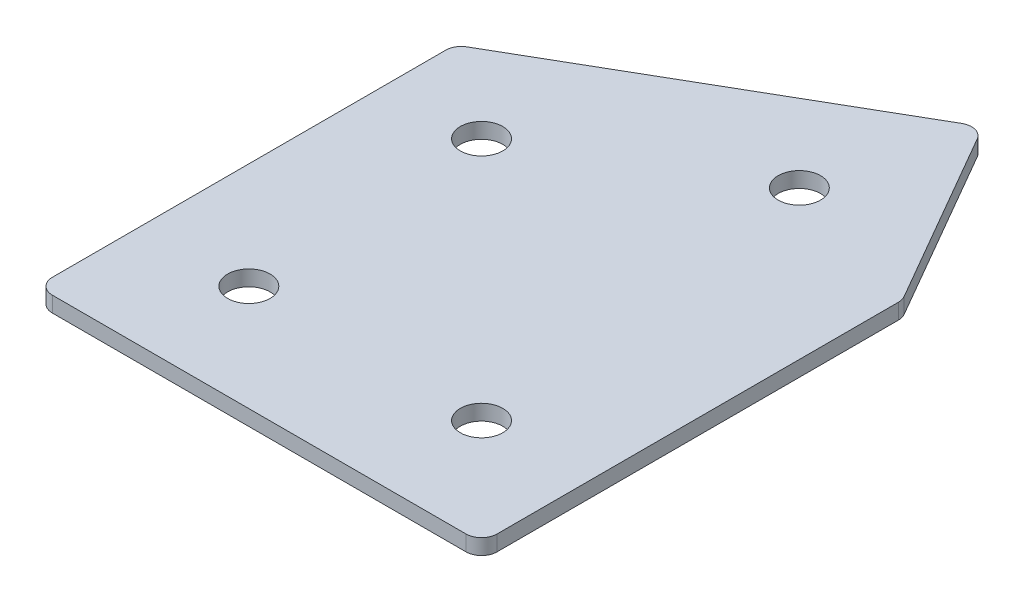
ISO-10303-21;
HEADER;
FILE_DESCRIPTION(('STEP AP214'),'2;1');
FILE_NAME('part.step','',(''),(''),'','','');
FILE_SCHEMA(('AUTOMOTIVE_DESIGN { 1 0 10303 214 1 1 1 1 }'));
ENDSEC;
DATA;
#1=APPLICATION_CONTEXT('core data for automotive mechanical design processes');
#2=APPLICATION_PROTOCOL_DEFINITION('international standard','automotive_design',2000,#1);
#3=PRODUCT_CONTEXT('',#1,'mechanical');
#4=PRODUCT('Part','Part','',(#3));
#5=PRODUCT_RELATED_PRODUCT_CATEGORY('part','',(#4));
#6=PRODUCT_DEFINITION_FORMATION('','',#4);
#7=PRODUCT_DEFINITION_CONTEXT('part definition',#1,'design');
#8=PRODUCT_DEFINITION('design','',#6,#7);
#9=PRODUCT_DEFINITION_SHAPE('','',#8);
#10=(LENGTH_UNIT() NAMED_UNIT(*) SI_UNIT(.MILLI.,.METRE.));
#11=(NAMED_UNIT(*) PLANE_ANGLE_UNIT() SI_UNIT($,.RADIAN.));
#12=(NAMED_UNIT(*) SI_UNIT($,.STERADIAN.) SOLID_ANGLE_UNIT());
#13=UNCERTAINTY_MEASURE_WITH_UNIT(LENGTH_MEASURE(1.E-05),#10,'distance_accuracy_value','');
#14=(GEOMETRIC_REPRESENTATION_CONTEXT(3) GLOBAL_UNCERTAINTY_ASSIGNED_CONTEXT((#13)) GLOBAL_UNIT_ASSIGNED_CONTEXT((#10,
#11,#12)) REPRESENTATION_CONTEXT('',''));
#15=CARTESIAN_POINT('',(0.,0.,0.));
#16=DIRECTION('',(0.,0.,1.));
#17=DIRECTION('',(1.,0.,0.));
#18=AXIS2_PLACEMENT_3D('',#15,#16,#17);
#19=CARTESIAN_POINT('',(0.,0.,0.));
#20=DIRECTION('',(0.,1.,0.));
#21=DIRECTION('',(0.,0.,1.));
#22=AXIS2_PLACEMENT_3D('',#19,#20,#21);
#23=PLANE('',#22);
#24=CARTESIAN_POINT('',(128.971143170306,0.,0.));
#25=DIRECTION('',(0.,1.,0.));
#26=DIRECTION('',(0.,0.,1.));
#27=AXIS2_PLACEMENT_3D('',#24,#25,#26);
#28=CIRCLE('',#27,4.09999999999999);
#29=CARTESIAN_POINT('',(128.971143170306,0.,4.09999999999999));
#30=VERTEX_POINT('',#29);
#31=EDGE_CURVE('E201',#30,#30,#28,.T.);
#32=ORIENTED_EDGE('',*,*,#31,.T.);
#33=EDGE_LOOP('',(#32));
#34=FACE_BOUND('',#33,.T.);
#35=CARTESIAN_POINT('',(120.735571585156,0.,-69.7067147554497));
#36=DIRECTION('',(0.,1.,0.));
#37=DIRECTION('',(0.,0.,1.));
#38=AXIS2_PLACEMENT_3D('',#35,#36,#37);
#39=CIRCLE('',#38,4.09999999999998);
#40=CARTESIAN_POINT('',(120.735571585156,0.,-65.6067147554498));
#41=VERTEX_POINT('',#40);
#42=EDGE_CURVE('E195',#41,#41,#39,.T.);
#43=ORIENTED_EDGE('',*,*,#42,.T.);
#44=EDGE_LOOP('',(#43));
#45=FACE_BOUND('',#44,.T.);
#46=CARTESIAN_POINT('',(81.764428414856,0.,-47.2067147554497));
#47=DIRECTION('',(0.,1.,0.));
#48=DIRECTION('',(0.,0.,1.));
#49=AXIS2_PLACEMENT_3D('',#46,#47,#48);
#50=CIRCLE('',#49,4.1);
#51=CARTESIAN_POINT('',(81.764428414856,0.,-43.1067147554497));
#52=VERTEX_POINT('',#51);
#53=EDGE_CURVE('E189',#52,#52,#50,.T.);
#54=ORIENTED_EDGE('',*,*,#53,.T.);
#55=EDGE_LOOP('',(#54));
#56=FACE_BOUND('',#55,.T.);
#57=CARTESIAN_POINT('',(83.9711431703057,0.,0.));
#58=DIRECTION('',(0.,1.,0.));
#59=DIRECTION('',(0.,0.,1.));
#60=AXIS2_PLACEMENT_3D('',#57,#58,#59);
#61=CIRCLE('',#60,4.1);
#62=CARTESIAN_POINT('',(83.9711431703057,0.,4.1));
#63=VERTEX_POINT('',#62);
#64=EDGE_CURVE('E115',#63,#63,#61,.T.);
#65=ORIENTED_EDGE('',*,*,#64,.T.);
#66=EDGE_LOOP('',(#65));
#67=FACE_BOUND('',#66,.T.);
#68=DIRECTION('',(0.,0.,1.));
#69=VECTOR('',#68,1.);
#70=CARTESIAN_POINT('',(63.4711431703057,0.,-60.3164426319208));
#71=LINE('',#70,#69);
#72=CARTESIAN_POINT('',(63.4711431703057,0.,-58.5843918243519));
#73=VERTEX_POINT('',#72);
#74=CARTESIAN_POINT('',(63.4711431703057,0.,17.5000000000001));
#75=VERTEX_POINT('',#74);
#76=EDGE_CURVE('E182',#73,#75,#71,.T.);
#77=ORIENTED_EDGE('',*,*,#76,.F.);
#78=CARTESIAN_POINT('',(66.4711431703057,0.,-58.5843918243519));
#79=DIRECTION('',(0.,1.,0.));
#80=DIRECTION('',(0.,0.,1.));
#81=AXIS2_PLACEMENT_3D('',#78,#79,#80);
#82=CIRCLE('',#81,3.);
#83=CARTESIAN_POINT('',(64.9711431703057,0.,-61.1824680357053));
#84=VERTEX_POINT('',#83);
#85=EDGE_CURVE('E146',#73,#84,#82,.F.);
#86=ORIENTED_EDGE('',*,*,#85,.T.);
#87=DIRECTION('',(-0.866025403784438,0.,0.5));
#88=VECTOR('',#87,1.);
#89=CARTESIAN_POINT('',(128.239092362737,0.,-97.7102355330308));
#90=LINE('',#89,#88);
#91=CARTESIAN_POINT('',(125.641016151383,0.,-96.2102355330308));
#92=VERTEX_POINT('',#91);
#93=EDGE_CURVE('E174',#92,#84,#90,.T.);
#94=ORIENTED_EDGE('',*,*,#93,.F.);
#95=CARTESIAN_POINT('',(127.141016151383,0.,-93.6121593216775));
#96=DIRECTION('',(0.,1.,0.));
#97=DIRECTION('',(0.,0.,1.));
#98=AXIS2_PLACEMENT_3D('',#95,#96,#97);
#99=CIRCLE('',#98,3.);
#100=CARTESIAN_POINT('',(129.739092362737,0.,-95.1121593216775));
#101=VERTEX_POINT('',#100);
#102=EDGE_CURVE('E118',#92,#101,#99,.F.);
#103=ORIENTED_EDGE('',*,*,#102,.T.);
#104=DIRECTION('',(-0.500000000000001,0.,-0.866025403784438));
#105=VECTOR('',#104,1.);
#106=CARTESIAN_POINT('',(149.471143170306,0.,-60.9352447854375));
#107=LINE('',#106,#105);
#108=CARTESIAN_POINT('',(149.069219381659,0.,-61.6313972081442));
#109=VERTEX_POINT('',#108);
#110=EDGE_CURVE('E119',#109,#101,#107,.T.);
#111=ORIENTED_EDGE('',*,*,#110,.F.);
#112=CARTESIAN_POINT('',(146.471143170306,0.,-60.1313972081442));
#113=DIRECTION('',(0.,1.,0.));
#114=DIRECTION('',(0.,0.,1.));
#115=AXIS2_PLACEMENT_3D('',#112,#113,#114);
#116=CIRCLE('',#115,3.);
#117=CARTESIAN_POINT('',(149.471143170306,0.,-60.1313972081441));
#118=VERTEX_POINT('',#117);
#119=EDGE_CURVE('E141',#109,#118,#116,.F.);
#120=ORIENTED_EDGE('',*,*,#119,.T.);
#121=DIRECTION('',(0.,0.,-1.));
#122=VECTOR('',#121,1.);
#123=CARTESIAN_POINT('',(149.471143170306,0.,20.5000000000001));
#124=LINE('',#123,#122);
#125=CARTESIAN_POINT('',(149.471143170306,0.,17.5000000000001));
#126=VERTEX_POINT('',#125);
#127=EDGE_CURVE('E123',#126,#118,#124,.T.);
#128=ORIENTED_EDGE('',*,*,#127,.F.);
#129=CARTESIAN_POINT('',(146.471143170306,0.,17.5000000000001));
#130=DIRECTION('',(0.,1.,0.));
#131=DIRECTION('',(0.,0.,1.));
#132=AXIS2_PLACEMENT_3D('',#129,#130,#131);
#133=CIRCLE('',#132,3.);
#134=CARTESIAN_POINT('',(146.471143170306,0.,20.5000000000001));
#135=VERTEX_POINT('',#134);
#136=EDGE_CURVE('E31',#126,#135,#133,.F.);
#137=ORIENTED_EDGE('',*,*,#136,.T.);
#138=DIRECTION('',(1.,0.,0.));
#139=VECTOR('',#138,1.);
#140=CARTESIAN_POINT('',(63.4711431703057,0.,20.5000000000001));
#141=LINE('',#140,#139);
#142=CARTESIAN_POINT('',(66.4711431703057,0.,20.5000000000001));
#143=VERTEX_POINT('',#142);
#144=EDGE_CURVE('E180',#143,#135,#141,.T.);
#145=ORIENTED_EDGE('',*,*,#144,.F.);
#146=CARTESIAN_POINT('',(66.4711431703057,0.,17.5000000000001));
#147=DIRECTION('',(0.,1.,0.));
#148=DIRECTION('',(0.,0.,1.));
#149=AXIS2_PLACEMENT_3D('',#146,#147,#148);
#150=CIRCLE('',#149,3.);
#151=EDGE_CURVE('E144',#143,#75,#150,.F.);
#152=ORIENTED_EDGE('',*,*,#151,.T.);
#153=EDGE_LOOP('',(#77,#86,#94,#103,#111,#120,#128,#137,#145,#152));
#154=FACE_BOUND('',#153,.T.);
#155=ADVANCED_FACE('F16',(#34,#45,#56,#67,#154),#23,.F.);
#156=CARTESIAN_POINT('',(128.239092362737,0.,-97.7102355330308));
#157=DIRECTION('',(-0.5,0.,-0.866025403784438));
#158=DIRECTION('',(-0.866025403784439,0.,0.5));
#159=AXIS2_PLACEMENT_3D('',#156,#157,#158);
#160=PLANE('',#159);
#161=ORIENTED_EDGE('',*,*,#93,.T.);
#162=DIRECTION('',(0.,1.,0.));
#163=VECTOR('',#162,1.);
#164=CARTESIAN_POINT('',(64.9711431703057,0.,-61.1824680357052));
#165=LINE('',#164,#163);
#166=CARTESIAN_POINT('',(64.9711431703057,3.,-61.1824680357053));
#167=VERTEX_POINT('',#166);
#168=EDGE_CURVE('E105',#84,#167,#165,.T.);
#169=ORIENTED_EDGE('',*,*,#168,.T.);
#170=DIRECTION('',(-0.866025403784438,0.,0.5));
#171=VECTOR('',#170,1.);
#172=CARTESIAN_POINT('',(128.239092362737,3.,-97.7102355330308));
#173=LINE('',#172,#171);
#174=CARTESIAN_POINT('',(125.641016151383,3.,-96.2102355330308));
#175=VERTEX_POINT('',#174);
#176=EDGE_CURVE('E97',#175,#167,#173,.T.);
#177=ORIENTED_EDGE('',*,*,#176,.F.);
#178=DIRECTION('',(0.,1.,0.));
#179=VECTOR('',#178,1.);
#180=CARTESIAN_POINT('',(125.641016151383,0.,-96.2102355330308));
#181=LINE('',#180,#179);
#182=EDGE_CURVE('E111',#175,#92,#181,.F.);
#183=ORIENTED_EDGE('',*,*,#182,.T.);
#184=EDGE_LOOP('',(#161,#169,#177,#183));
#185=FACE_BOUND('',#184,.T.);
#186=ADVANCED_FACE('F110',(#185),#160,.T.);
#187=CARTESIAN_POINT('',(149.471143170306,0.,-60.9352447854375));
#188=DIRECTION('',(0.866025403784438,0.,-0.500000000000001));
#189=DIRECTION('',(-0.500000000000001,0.,-0.866025403784438));
#190=AXIS2_PLACEMENT_3D('',#187,#188,#189);
#191=PLANE('',#190);
#192=DIRECTION('',(-0.500000000000001,0.,-0.866025403784438));
#193=VECTOR('',#192,1.);
#194=CARTESIAN_POINT('',(149.471143170306,3.,-60.9352447854375));
#195=LINE('',#194,#193);
#196=CARTESIAN_POINT('',(149.069219381659,3.,-61.6313972081442));
#197=VERTEX_POINT('',#196);
#198=CARTESIAN_POINT('',(129.739092362737,3.,-95.1121593216775));
#199=VERTEX_POINT('',#198);
#200=EDGE_CURVE('E99',#197,#199,#195,.T.);
#201=ORIENTED_EDGE('',*,*,#200,.F.);
#202=DIRECTION('',(0.,1.,0.));
#203=VECTOR('',#202,1.);
#204=CARTESIAN_POINT('',(149.069219381659,0.,-61.6313972081442));
#205=LINE('',#204,#203);
#206=EDGE_CURVE('E10',#197,#109,#205,.F.);
#207=ORIENTED_EDGE('',*,*,#206,.T.);
#208=ORIENTED_EDGE('',*,*,#110,.T.);
#209=DIRECTION('',(0.,1.,0.));
#210=VECTOR('',#209,1.);
#211=CARTESIAN_POINT('',(129.739092362737,0.,-95.1121593216775));
#212=LINE('',#211,#210);
#213=EDGE_CURVE('E24',#101,#199,#212,.T.);
#214=ORIENTED_EDGE('',*,*,#213,.T.);
#215=EDGE_LOOP('',(#201,#207,#208,#214));
#216=FACE_BOUND('',#215,.T.);
#217=ADVANCED_FACE('F157',(#216),#191,.T.);
#218=CARTESIAN_POINT('',(149.471143170306,0.,20.5000000000001));
#219=DIRECTION('',(1.,0.,0.));
#220=DIRECTION('',(0.,0.,-1.));
#221=AXIS2_PLACEMENT_3D('',#218,#219,#220);
#222=PLANE('',#221);
#223=DIRECTION('',(0.,0.,-1.));
#224=VECTOR('',#223,1.);
#225=CARTESIAN_POINT('',(149.471143170306,3.,20.5000000000001));
#226=LINE('',#225,#224);
#227=CARTESIAN_POINT('',(149.471143170306,3.,17.5000000000001));
#228=VERTEX_POINT('',#227);
#229=CARTESIAN_POINT('',(149.471143170306,3.,-60.1313972081441));
#230=VERTEX_POINT('',#229);
#231=EDGE_CURVE('E170',#228,#230,#226,.T.);
#232=ORIENTED_EDGE('',*,*,#231,.F.);
#233=DIRECTION('',(0.,1.,0.));
#234=VECTOR('',#233,1.);
#235=CARTESIAN_POINT('',(149.471143170306,0.,17.5000000000001));
#236=LINE('',#235,#234);
#237=EDGE_CURVE('E155',#228,#126,#236,.F.);
#238=ORIENTED_EDGE('',*,*,#237,.T.);
#239=ORIENTED_EDGE('',*,*,#127,.T.);
#240=DIRECTION('',(0.,1.,0.));
#241=VECTOR('',#240,1.);
#242=CARTESIAN_POINT('',(149.471143170306,0.,-60.1313972081442));
#243=LINE('',#242,#241);
#244=EDGE_CURVE('E152',#118,#230,#243,.T.);
#245=ORIENTED_EDGE('',*,*,#244,.T.);
#246=EDGE_LOOP('',(#232,#238,#239,#245));
#247=FACE_BOUND('',#246,.T.);
#248=ADVANCED_FACE('F169',(#247),#222,.T.);
#249=CARTESIAN_POINT('',(63.4711431703057,0.,20.5000000000001));
#250=DIRECTION('',(0.,0.,1.));
#251=DIRECTION('',(1.,0.,0.));
#252=AXIS2_PLACEMENT_3D('',#249,#250,#251);
#253=PLANE('',#252);
#254=DIRECTION('',(1.,0.,0.));
#255=VECTOR('',#254,1.);
#256=CARTESIAN_POINT('',(63.4711431703057,3.,20.5000000000001));
#257=LINE('',#256,#255);
#258=CARTESIAN_POINT('',(66.4711431703057,3.,20.5000000000001));
#259=VERTEX_POINT('',#258);
#260=CARTESIAN_POINT('',(146.471143170306,3.,20.5000000000001));
#261=VERTEX_POINT('',#260);
#262=EDGE_CURVE('E173',#259,#261,#257,.T.);
#263=ORIENTED_EDGE('',*,*,#262,.F.);
#264=DIRECTION('',(0.,1.,0.));
#265=VECTOR('',#264,1.);
#266=CARTESIAN_POINT('',(66.4711431703057,0.,20.5000000000001));
#267=LINE('',#266,#265);
#268=EDGE_CURVE('E38',#259,#143,#267,.F.);
#269=ORIENTED_EDGE('',*,*,#268,.T.);
#270=ORIENTED_EDGE('',*,*,#144,.T.);
#271=DIRECTION('',(0.,1.,0.));
#272=VECTOR('',#271,1.);
#273=CARTESIAN_POINT('',(146.471143170306,0.,20.5000000000001));
#274=LINE('',#273,#272);
#275=EDGE_CURVE('E148',#135,#261,#274,.T.);
#276=ORIENTED_EDGE('',*,*,#275,.T.);
#277=EDGE_LOOP('',(#263,#269,#270,#276));
#278=FACE_BOUND('',#277,.T.);
#279=ADVANCED_FACE('F337',(#278),#253,.T.);
#280=CARTESIAN_POINT('',(63.4711431703057,0.,-60.3164426319208));
#281=DIRECTION('',(-1.,0.,0.));
#282=DIRECTION('',(0.,0.,1.));
#283=AXIS2_PLACEMENT_3D('',#280,#281,#282);
#284=PLANE('',#283);
#285=DIRECTION('',(0.,0.,1.));
#286=VECTOR('',#285,1.);
#287=CARTESIAN_POINT('',(63.4711431703057,3.,-60.3164426319208));
#288=LINE('',#287,#286);
#289=CARTESIAN_POINT('',(63.4711431703057,3.,-58.5843918243519));
#290=VERTEX_POINT('',#289);
#291=CARTESIAN_POINT('',(63.4711431703057,3.,17.5000000000001));
#292=VERTEX_POINT('',#291);
#293=EDGE_CURVE('E114',#290,#292,#288,.T.);
#294=ORIENTED_EDGE('',*,*,#293,.F.);
#295=DIRECTION('',(0.,1.,0.));
#296=VECTOR('',#295,1.);
#297=CARTESIAN_POINT('',(63.4711431703057,0.,-58.5843918243519));
#298=LINE('',#297,#296);
#299=EDGE_CURVE('E138',#290,#73,#298,.F.);
#300=ORIENTED_EDGE('',*,*,#299,.T.);
#301=ORIENTED_EDGE('',*,*,#76,.T.);
#302=DIRECTION('',(0.,1.,0.));
#303=VECTOR('',#302,1.);
#304=CARTESIAN_POINT('',(63.4711431703057,0.,17.5000000000001));
#305=LINE('',#304,#303);
#306=EDGE_CURVE('E135',#75,#292,#305,.T.);
#307=ORIENTED_EDGE('',*,*,#306,.T.);
#308=EDGE_LOOP('',(#294,#300,#301,#307));
#309=FACE_BOUND('',#308,.T.);
#310=ADVANCED_FACE('F223',(#309),#284,.T.);
#311=CARTESIAN_POINT('',(0.,3.,0.));
#312=DIRECTION('',(0.,1.,0.));
#313=DIRECTION('',(0.,0.,1.));
#314=AXIS2_PLACEMENT_3D('',#311,#312,#313);
#315=PLANE('',#314);
#316=CARTESIAN_POINT('',(128.971143170306,3.,0.));
#317=DIRECTION('',(0.,1.,0.));
#318=DIRECTION('',(0.,0.,1.));
#319=AXIS2_PLACEMENT_3D('',#316,#317,#318);
#320=CIRCLE('',#319,4.09999999999999);
#321=CARTESIAN_POINT('',(128.971143170306,3.,4.09999999999999));
#322=VERTEX_POINT('',#321);
#323=EDGE_CURVE('E204',#322,#322,#320,.T.);
#324=ORIENTED_EDGE('',*,*,#323,.F.);
#325=EDGE_LOOP('',(#324));
#326=FACE_BOUND('',#325,.T.);
#327=CARTESIAN_POINT('',(120.735571585156,3.,-69.7067147554497));
#328=DIRECTION('',(0.,1.,0.));
#329=DIRECTION('',(0.,0.,1.));
#330=AXIS2_PLACEMENT_3D('',#327,#328,#329);
#331=CIRCLE('',#330,4.09999999999998);
#332=CARTESIAN_POINT('',(120.735571585156,3.,-65.6067147554498));
#333=VERTEX_POINT('',#332);
#334=EDGE_CURVE('E198',#333,#333,#331,.T.);
#335=ORIENTED_EDGE('',*,*,#334,.F.);
#336=EDGE_LOOP('',(#335));
#337=FACE_BOUND('',#336,.T.);
#338=CARTESIAN_POINT('',(81.764428414856,3.,-47.2067147554497));
#339=DIRECTION('',(0.,1.,0.));
#340=DIRECTION('',(0.,0.,1.));
#341=AXIS2_PLACEMENT_3D('',#338,#339,#340);
#342=CIRCLE('',#341,4.1);
#343=CARTESIAN_POINT('',(81.764428414856,3.,-43.1067147554497));
#344=VERTEX_POINT('',#343);
#345=EDGE_CURVE('E192',#344,#344,#342,.T.);
#346=ORIENTED_EDGE('',*,*,#345,.F.);
#347=EDGE_LOOP('',(#346));
#348=FACE_BOUND('',#347,.T.);
#349=CARTESIAN_POINT('',(83.9711431703057,3.,0.));
#350=DIRECTION('',(0.,1.,0.));
#351=DIRECTION('',(0.,0.,1.));
#352=AXIS2_PLACEMENT_3D('',#349,#350,#351);
#353=CIRCLE('',#352,4.1);
#354=CARTESIAN_POINT('',(83.9711431703057,3.,4.1));
#355=VERTEX_POINT('',#354);
#356=EDGE_CURVE('E186',#355,#355,#353,.T.);
#357=ORIENTED_EDGE('',*,*,#356,.F.);
#358=EDGE_LOOP('',(#357));
#359=FACE_BOUND('',#358,.T.);
#360=ORIENTED_EDGE('',*,*,#176,.T.);
#361=CARTESIAN_POINT('',(66.4711431703057,3.,-58.5843918243519));
#362=DIRECTION('',(0.,1.,0.));
#363=DIRECTION('',(0.,0.,1.));
#364=AXIS2_PLACEMENT_3D('',#361,#362,#363);
#365=CIRCLE('',#364,3.);
#366=EDGE_CURVE('E133',#167,#290,#365,.T.);
#367=ORIENTED_EDGE('',*,*,#366,.T.);
#368=ORIENTED_EDGE('',*,*,#293,.T.);
#369=CARTESIAN_POINT('',(66.4711431703057,3.,17.5000000000001));
#370=DIRECTION('',(0.,1.,0.));
#371=DIRECTION('',(0.,0.,1.));
#372=AXIS2_PLACEMENT_3D('',#369,#370,#371);
#373=CIRCLE('',#372,3.);
#374=EDGE_CURVE('E131',#292,#259,#373,.T.);
#375=ORIENTED_EDGE('',*,*,#374,.T.);
#376=ORIENTED_EDGE('',*,*,#262,.T.);
#377=CARTESIAN_POINT('',(146.471143170306,3.,17.5000000000001));
#378=DIRECTION('',(0.,1.,0.));
#379=DIRECTION('',(0.,0.,1.));
#380=AXIS2_PLACEMENT_3D('',#377,#378,#379);
#381=CIRCLE('',#380,3.);
#382=EDGE_CURVE('E129',#261,#228,#381,.T.);
#383=ORIENTED_EDGE('',*,*,#382,.T.);
#384=ORIENTED_EDGE('',*,*,#231,.T.);
#385=CARTESIAN_POINT('',(146.471143170306,3.,-60.1313972081442));
#386=DIRECTION('',(0.,1.,0.));
#387=DIRECTION('',(0.,0.,1.));
#388=AXIS2_PLACEMENT_3D('',#385,#386,#387);
#389=CIRCLE('',#388,3.);
#390=EDGE_CURVE('E104',#230,#197,#389,.T.);
#391=ORIENTED_EDGE('',*,*,#390,.T.);
#392=ORIENTED_EDGE('',*,*,#200,.T.);
#393=CARTESIAN_POINT('',(127.141016151383,3.,-93.6121593216775));
#394=DIRECTION('',(0.,1.,0.));
#395=DIRECTION('',(0.,0.,1.));
#396=AXIS2_PLACEMENT_3D('',#393,#394,#395);
#397=CIRCLE('',#396,3.);
#398=EDGE_CURVE('E94',#199,#175,#397,.T.);
#399=ORIENTED_EDGE('',*,*,#398,.T.);
#400=EDGE_LOOP('',(#360,#367,#368,#375,#376,#383,#384,#391,#392,#399));
#401=FACE_BOUND('',#400,.T.);
#402=ADVANCED_FACE('F96',(#326,#337,#348,#359,#401),#315,.T.);
#403=CARTESIAN_POINT('',(83.9711431703057,0.,0.));
#404=DIRECTION('',(0.,1.,0.));
#405=DIRECTION('',(0.,0.,1.));
#406=AXIS2_PLACEMENT_3D('',#403,#404,#405);
#407=CYLINDRICAL_SURFACE('',#406,4.1);
#408=ORIENTED_EDGE('',*,*,#64,.F.);
#409=EDGE_LOOP('',(#408));
#410=FACE_BOUND('',#409,.T.);
#411=ORIENTED_EDGE('',*,*,#356,.T.);
#412=EDGE_LOOP('',(#411));
#413=FACE_BOUND('',#412,.T.);
#414=ADVANCED_FACE('F222',(#410,#413),#407,.F.);
#415=CARTESIAN_POINT('',(81.764428414856,0.,-47.2067147554497));
#416=DIRECTION('',(0.,1.,0.));
#417=DIRECTION('',(0.,0.,1.));
#418=AXIS2_PLACEMENT_3D('',#415,#416,#417);
#419=CYLINDRICAL_SURFACE('',#418,4.1);
#420=ORIENTED_EDGE('',*,*,#53,.F.);
#421=EDGE_LOOP('',(#420));
#422=FACE_BOUND('',#421,.T.);
#423=ORIENTED_EDGE('',*,*,#345,.T.);
#424=EDGE_LOOP('',(#423));
#425=FACE_BOUND('',#424,.T.);
#426=ADVANCED_FACE('F232',(#422,#425),#419,.F.);
#427=CARTESIAN_POINT('',(120.735571585156,0.,-69.7067147554497));
#428=DIRECTION('',(0.,1.,0.));
#429=DIRECTION('',(0.,0.,1.));
#430=AXIS2_PLACEMENT_3D('',#427,#428,#429);
#431=CYLINDRICAL_SURFACE('',#430,4.09999999999998);
#432=ORIENTED_EDGE('',*,*,#42,.F.);
#433=EDGE_LOOP('',(#432));
#434=FACE_BOUND('',#433,.T.);
#435=ORIENTED_EDGE('',*,*,#334,.T.);
#436=EDGE_LOOP('',(#435));
#437=FACE_BOUND('',#436,.T.);
#438=ADVANCED_FACE('F216',(#434,#437),#431,.F.);
#439=CARTESIAN_POINT('',(128.971143170306,0.,0.));
#440=DIRECTION('',(0.,1.,0.));
#441=DIRECTION('',(0.,0.,1.));
#442=AXIS2_PLACEMENT_3D('',#439,#440,#441);
#443=CYLINDRICAL_SURFACE('',#442,4.09999999999999);
#444=ORIENTED_EDGE('',*,*,#31,.F.);
#445=EDGE_LOOP('',(#444));
#446=FACE_BOUND('',#445,.T.);
#447=ORIENTED_EDGE('',*,*,#323,.T.);
#448=EDGE_LOOP('',(#447));
#449=FACE_BOUND('',#448,.T.);
#450=ADVANCED_FACE('F212',(#446,#449),#443,.F.);
#451=CARTESIAN_POINT('',(66.4711431703057,0.,-58.5843918243519));
#452=DIRECTION('',(0.,1.,0.));
#453=DIRECTION('',(0.,0.,1.));
#454=AXIS2_PLACEMENT_3D('',#451,#452,#453);
#455=CYLINDRICAL_SURFACE('',#454,3.);
#456=ORIENTED_EDGE('',*,*,#85,.F.);
#457=ORIENTED_EDGE('',*,*,#299,.F.);
#458=ORIENTED_EDGE('',*,*,#366,.F.);
#459=ORIENTED_EDGE('',*,*,#168,.F.);
#460=EDGE_LOOP('',(#456,#457,#458,#459));
#461=FACE_BOUND('',#460,.T.);
#462=ADVANCED_FACE('F215',(#461),#455,.T.);
#463=CARTESIAN_POINT('',(66.4711431703057,0.,17.5000000000001));
#464=DIRECTION('',(0.,1.,0.));
#465=DIRECTION('',(0.,0.,1.));
#466=AXIS2_PLACEMENT_3D('',#463,#464,#465);
#467=CYLINDRICAL_SURFACE('',#466,3.);
#468=ORIENTED_EDGE('',*,*,#151,.F.);
#469=ORIENTED_EDGE('',*,*,#268,.F.);
#470=ORIENTED_EDGE('',*,*,#374,.F.);
#471=ORIENTED_EDGE('',*,*,#306,.F.);
#472=EDGE_LOOP('',(#468,#469,#470,#471));
#473=FACE_BOUND('',#472,.T.);
#474=ADVANCED_FACE('F252',(#473),#467,.T.);
#475=CARTESIAN_POINT('',(146.471143170306,0.,17.5000000000001));
#476=DIRECTION('',(0.,1.,0.));
#477=DIRECTION('',(0.,0.,1.));
#478=AXIS2_PLACEMENT_3D('',#475,#476,#477);
#479=CYLINDRICAL_SURFACE('',#478,3.);
#480=ORIENTED_EDGE('',*,*,#136,.F.);
#481=ORIENTED_EDGE('',*,*,#237,.F.);
#482=ORIENTED_EDGE('',*,*,#382,.F.);
#483=ORIENTED_EDGE('',*,*,#275,.F.);
#484=EDGE_LOOP('',(#480,#481,#482,#483));
#485=FACE_BOUND('',#484,.T.);
#486=ADVANCED_FACE('F256',(#485),#479,.T.);
#487=CARTESIAN_POINT('',(146.471143170306,0.,-60.1313972081442));
#488=DIRECTION('',(0.,1.,0.));
#489=DIRECTION('',(0.,0.,1.));
#490=AXIS2_PLACEMENT_3D('',#487,#488,#489);
#491=CYLINDRICAL_SURFACE('',#490,3.);
#492=ORIENTED_EDGE('',*,*,#119,.F.);
#493=ORIENTED_EDGE('',*,*,#206,.F.);
#494=ORIENTED_EDGE('',*,*,#390,.F.);
#495=ORIENTED_EDGE('',*,*,#244,.F.);
#496=EDGE_LOOP('',(#492,#493,#494,#495));
#497=FACE_BOUND('',#496,.T.);
#498=ADVANCED_FACE('F165',(#497),#491,.T.);
#499=CARTESIAN_POINT('',(127.141016151383,0.,-93.6121593216775));
#500=DIRECTION('',(0.,1.,0.));
#501=DIRECTION('',(0.,0.,1.));
#502=AXIS2_PLACEMENT_3D('',#499,#500,#501);
#503=CYLINDRICAL_SURFACE('',#502,3.);
#504=ORIENTED_EDGE('',*,*,#102,.F.);
#505=ORIENTED_EDGE('',*,*,#182,.F.);
#506=ORIENTED_EDGE('',*,*,#398,.F.);
#507=ORIENTED_EDGE('',*,*,#213,.F.);
#508=EDGE_LOOP('',(#504,#505,#506,#507));
#509=FACE_BOUND('',#508,.T.);
#510=ADVANCED_FACE('F18',(#509),#503,.T.);
#511=CLOSED_SHELL('',(#155,#186,#217,#248,#279,#310,#402,#414,#426,#438,#450,#462,#474,#486,
#498,#510));
#512=MANIFOLD_SOLID_BREP('B1',#511);
#513=ADVANCED_BREP_SHAPE_REPRESENTATION('',(#18,#512),#14);
#514=SHAPE_DEFINITION_REPRESENTATION(#9,#513);
ENDSEC;
END-ISO-10303-21;
